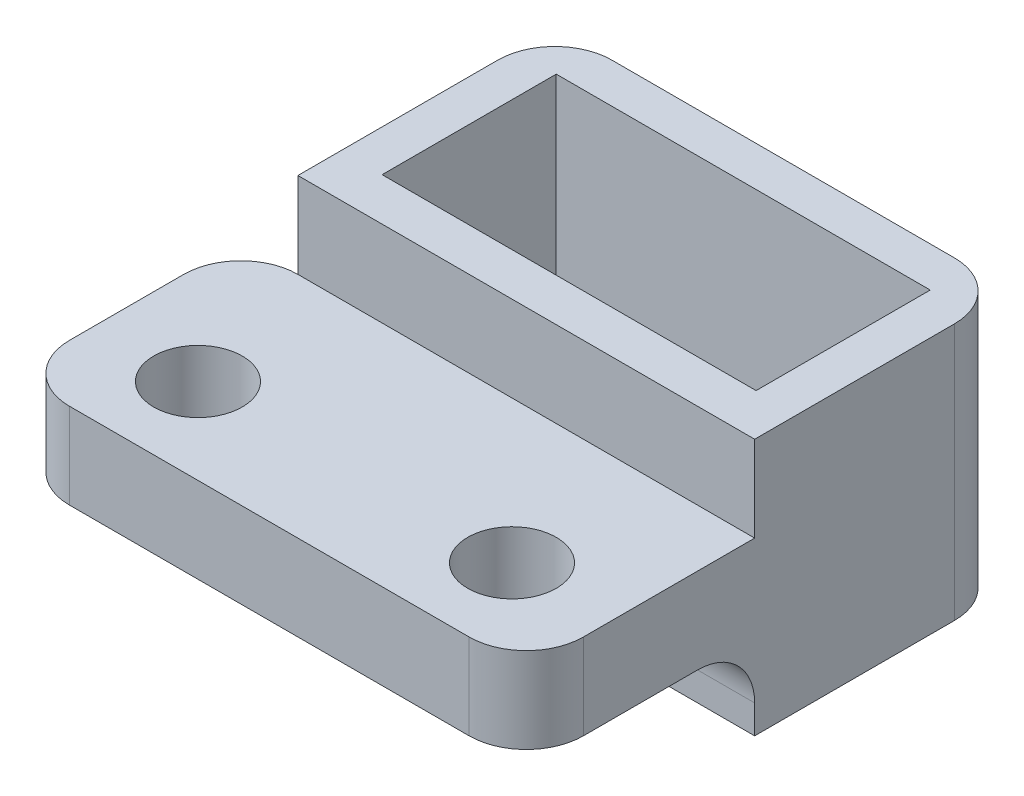
ISO-10303-21;
HEADER;
FILE_DESCRIPTION(('STEP AP214'),'2;1');
FILE_NAME('part.step','',(''),(''),'','','');
FILE_SCHEMA(('AUTOMOTIVE_DESIGN { 1 0 10303 214 1 1 1 1 }'));
ENDSEC;
DATA;
#1=APPLICATION_CONTEXT('core data for automotive mechanical design processes');
#2=APPLICATION_PROTOCOL_DEFINITION('international standard','automotive_design',2000,#1);
#3=PRODUCT_CONTEXT('',#1,'mechanical');
#4=PRODUCT('Part','Part','',(#3));
#5=PRODUCT_RELATED_PRODUCT_CATEGORY('part','',(#4));
#6=PRODUCT_DEFINITION_FORMATION('','',#4);
#7=PRODUCT_DEFINITION_CONTEXT('part definition',#1,'design');
#8=PRODUCT_DEFINITION('design','',#6,#7);
#9=PRODUCT_DEFINITION_SHAPE('','',#8);
#10=(LENGTH_UNIT() NAMED_UNIT(*) SI_UNIT(.MILLI.,.METRE.));
#11=(NAMED_UNIT(*) PLANE_ANGLE_UNIT() SI_UNIT($,.RADIAN.));
#12=(NAMED_UNIT(*) SI_UNIT($,.STERADIAN.) SOLID_ANGLE_UNIT());
#13=UNCERTAINTY_MEASURE_WITH_UNIT(LENGTH_MEASURE(1.E-05),#10,'distance_accuracy_value','');
#14=(GEOMETRIC_REPRESENTATION_CONTEXT(3) GLOBAL_UNCERTAINTY_ASSIGNED_CONTEXT((#13)) GLOBAL_UNIT_ASSIGNED_CONTEXT((#10,
#11,#12)) REPRESENTATION_CONTEXT('',''));
#15=CARTESIAN_POINT('',(0.,0.,0.));
#16=DIRECTION('',(0.,0.,1.));
#17=DIRECTION('',(1.,0.,0.));
#18=AXIS2_PLACEMENT_3D('',#15,#16,#17);
#19=CARTESIAN_POINT('',(3.45,-14.450605523645,-9.5));
#20=DIRECTION('',(0.,0.,1.));
#21=DIRECTION('',(1.,0.,0.));
#22=AXIS2_PLACEMENT_3D('',#19,#20,#21);
#23=PLANE('',#22);
#24=DIRECTION('',(-1.,0.,0.));
#25=VECTOR('',#24,1.);
#26=CARTESIAN_POINT('',(16.55,-0.5,-9.5));
#27=LINE('',#26,#25);
#28=CARTESIAN_POINT('',(16.55,-0.5,-9.5));
#29=VERTEX_POINT('',#28);
#30=CARTESIAN_POINT('',(3.45,-0.5,-9.5));
#31=VERTEX_POINT('',#30);
#32=EDGE_CURVE('E234',#29,#31,#27,.T.);
#33=ORIENTED_EDGE('',*,*,#32,.T.);
#34=DIRECTION('',(0.,1.,0.));
#35=VECTOR('',#34,1.);
#36=CARTESIAN_POINT('',(3.45,-14.450605523645,-9.5));
#37=LINE('',#36,#35);
#38=CARTESIAN_POINT('',(3.45,6.,-9.5));
#39=VERTEX_POINT('',#38);
#40=EDGE_CURVE('E267',#31,#39,#37,.T.);
#41=ORIENTED_EDGE('',*,*,#40,.T.);
#42=DIRECTION('',(1.,0.,0.));
#43=VECTOR('',#42,1.);
#44=CARTESIAN_POINT('',(3.45,6.,-9.5));
#45=LINE('',#44,#43);
#46=CARTESIAN_POINT('',(16.55,6.,-9.5));
#47=VERTEX_POINT('',#46);
#48=EDGE_CURVE('E260',#39,#47,#45,.T.);
#49=ORIENTED_EDGE('',*,*,#48,.T.);
#50=DIRECTION('',(0.,1.,0.));
#51=VECTOR('',#50,1.);
#52=CARTESIAN_POINT('',(16.55,-14.450605523645,-9.5));
#53=LINE('',#52,#51);
#54=EDGE_CURVE('E256',#29,#47,#53,.T.);
#55=ORIENTED_EDGE('',*,*,#54,.F.);
#56=EDGE_LOOP('',(#33,#41,#49,#55));
#57=FACE_BOUND('',#56,.T.);
#58=ADVANCED_FACE('F33',(#57),#23,.F.);
#59=CARTESIAN_POINT('',(16.55,-14.450605523645,-15.6));
#60=DIRECTION('',(1.,0.,0.));
#61=DIRECTION('',(0.,0.,-1.));
#62=AXIS2_PLACEMENT_3D('',#59,#60,#61);
#63=PLANE('',#62);
#64=DIRECTION('',(0.,0.,1.));
#65=VECTOR('',#64,1.);
#66=CARTESIAN_POINT('',(16.55,-0.5,-15.6));
#67=LINE('',#66,#65);
#68=CARTESIAN_POINT('',(16.55,-0.5,-15.6));
#69=VERTEX_POINT('',#68);
#70=EDGE_CURVE('E232',#69,#29,#67,.T.);
#71=ORIENTED_EDGE('',*,*,#70,.T.);
#72=ORIENTED_EDGE('',*,*,#54,.T.);
#73=DIRECTION('',(0.,0.,-1.));
#74=VECTOR('',#73,1.);
#75=CARTESIAN_POINT('',(16.55,6.,-15.6));
#76=LINE('',#75,#74);
#77=CARTESIAN_POINT('',(16.55,6.,-15.6));
#78=VERTEX_POINT('',#77);
#79=EDGE_CURVE('E257',#47,#78,#76,.T.);
#80=ORIENTED_EDGE('',*,*,#79,.T.);
#81=DIRECTION('',(0.,1.,0.));
#82=VECTOR('',#81,1.);
#83=CARTESIAN_POINT('',(16.55,-14.450605523645,-15.6));
#84=LINE('',#83,#82);
#85=EDGE_CURVE('E268',#69,#78,#84,.T.);
#86=ORIENTED_EDGE('',*,*,#85,.F.);
#87=EDGE_LOOP('',(#71,#72,#80,#86));
#88=FACE_BOUND('',#87,.T.);
#89=ADVANCED_FACE('F453',(#88),#63,.F.);
#90=CARTESIAN_POINT('',(3.45,-14.450605523645,-15.6));
#91=DIRECTION('',(0.,0.,-1.));
#92=DIRECTION('',(-1.,0.,0.));
#93=AXIS2_PLACEMENT_3D('',#90,#91,#92);
#94=PLANE('',#93);
#95=DIRECTION('',(1.,0.,0.));
#96=VECTOR('',#95,1.);
#97=CARTESIAN_POINT('',(3.45,-0.5,-15.6));
#98=LINE('',#97,#96);
#99=CARTESIAN_POINT('',(3.45,-0.5,-15.6));
#100=VERTEX_POINT('',#99);
#101=EDGE_CURVE('E227',#100,#69,#98,.T.);
#102=ORIENTED_EDGE('',*,*,#101,.T.);
#103=ORIENTED_EDGE('',*,*,#85,.T.);
#104=DIRECTION('',(-1.,0.,0.));
#105=VECTOR('',#104,1.);
#106=CARTESIAN_POINT('',(3.45,6.,-15.6));
#107=LINE('',#106,#105);
#108=CARTESIAN_POINT('',(3.45,6.,-15.6));
#109=VERTEX_POINT('',#108);
#110=EDGE_CURVE('E253',#78,#109,#107,.T.);
#111=ORIENTED_EDGE('',*,*,#110,.T.);
#112=DIRECTION('',(0.,1.,0.));
#113=VECTOR('',#112,1.);
#114=CARTESIAN_POINT('',(3.45,-14.450605523645,-15.6));
#115=LINE('',#114,#113);
#116=EDGE_CURVE('E265',#100,#109,#115,.T.);
#117=ORIENTED_EDGE('',*,*,#116,.F.);
#118=EDGE_LOOP('',(#102,#103,#111,#117));
#119=FACE_BOUND('',#118,.T.);
#120=ADVANCED_FACE('F446',(#119),#94,.F.);
#121=CARTESIAN_POINT('',(3.45,-14.450605523645,-15.6));
#122=DIRECTION('',(-1.,0.,0.));
#123=DIRECTION('',(0.,0.,1.));
#124=AXIS2_PLACEMENT_3D('',#121,#122,#123);
#125=PLANE('',#124);
#126=DIRECTION('',(0.,0.,-1.));
#127=VECTOR('',#126,1.);
#128=CARTESIAN_POINT('',(3.45,-0.5,-9.5));
#129=LINE('',#128,#127);
#130=EDGE_CURVE('E237',#31,#100,#129,.T.);
#131=ORIENTED_EDGE('',*,*,#130,.T.);
#132=ORIENTED_EDGE('',*,*,#116,.T.);
#133=DIRECTION('',(0.,0.,1.));
#134=VECTOR('',#133,1.);
#135=CARTESIAN_POINT('',(3.45,6.,-15.6));
#136=LINE('',#135,#134);
#137=EDGE_CURVE('E252',#109,#39,#136,.T.);
#138=ORIENTED_EDGE('',*,*,#137,.T.);
#139=ORIENTED_EDGE('',*,*,#40,.F.);
#140=EDGE_LOOP('',(#131,#132,#138,#139));
#141=FACE_BOUND('',#140,.T.);
#142=ADVANCED_FACE('F438',(#141),#125,.F.);
#143=CARTESIAN_POINT('',(0.,3.,0.));
#144=DIRECTION('',(0.,-1.,0.));
#145=DIRECTION('',(0.,0.,-1.));
#146=AXIS2_PLACEMENT_3D('',#143,#144,#145);
#147=PLANE('',#146);
#148=CARTESIAN_POINT('',(14.5,3.,-3.));
#149=DIRECTION('',(0.,1.,0.));
#150=DIRECTION('',(0.,0.,1.));
#151=AXIS2_PLACEMENT_3D('',#148,#149,#150);
#152=CIRCLE('',#151,1.55);
#153=CARTESIAN_POINT('',(14.5,3.,-1.45));
#154=VERTEX_POINT('',#153);
#155=EDGE_CURVE('E290',#154,#154,#152,.T.);
#156=ORIENTED_EDGE('',*,*,#155,.F.);
#157=EDGE_LOOP('',(#156));
#158=FACE_BOUND('',#157,.T.);
#159=CARTESIAN_POINT('',(3.5,3.,-3.));
#160=DIRECTION('',(0.,1.,0.));
#161=DIRECTION('',(0.,0.,1.));
#162=AXIS2_PLACEMENT_3D('',#159,#160,#161);
#163=CIRCLE('',#162,1.55);
#164=CARTESIAN_POINT('',(3.5,3.,-1.45));
#165=VERTEX_POINT('',#164);
#166=EDGE_CURVE('E296',#165,#165,#163,.T.);
#167=ORIENTED_EDGE('',*,*,#166,.F.);
#168=EDGE_LOOP('',(#167));
#169=FACE_BOUND('',#168,.T.);
#170=DIRECTION('',(1.,0.,0.));
#171=VECTOR('',#170,1.);
#172=CARTESIAN_POINT('',(0.,3.,0.));
#173=LINE('',#172,#171);
#174=CARTESIAN_POINT('',(2.,3.,0.));
#175=VERTEX_POINT('',#174);
#176=CARTESIAN_POINT('',(16.,3.,0.));
#177=VERTEX_POINT('',#176);
#178=EDGE_CURVE('E305',#175,#177,#173,.T.);
#179=ORIENTED_EDGE('',*,*,#178,.T.);
#180=CARTESIAN_POINT('',(16.,3.,-2.));
#181=DIRECTION('',(0.,-1.,0.));
#182=DIRECTION('',(0.,0.,-1.));
#183=AXIS2_PLACEMENT_3D('',#180,#181,#182);
#184=CIRCLE('',#183,2.);
#185=CARTESIAN_POINT('',(18.,3.,-2.));
#186=VERTEX_POINT('',#185);
#187=EDGE_CURVE('E342',#177,#186,#184,.F.);
#188=ORIENTED_EDGE('',*,*,#187,.T.);
#189=DIRECTION('',(0.,0.,-1.));
#190=VECTOR('',#189,1.);
#191=CARTESIAN_POINT('',(18.,3.,0.));
#192=LINE('',#191,#190);
#193=CARTESIAN_POINT('',(18.,3.,-8.));
#194=VERTEX_POINT('',#193);
#195=EDGE_CURVE('E309',#186,#194,#192,.T.);
#196=ORIENTED_EDGE('',*,*,#195,.T.);
#197=DIRECTION('',(1.,0.,0.));
#198=VECTOR('',#197,1.);
#199=CARTESIAN_POINT('',(0.,3.,-8.));
#200=LINE('',#199,#198);
#201=CARTESIAN_POINT('',(2.,3.,-8.));
#202=VERTEX_POINT('',#201);
#203=EDGE_CURVE('E278',#202,#194,#200,.T.);
#204=ORIENTED_EDGE('',*,*,#203,.F.);
#205=CARTESIAN_POINT('',(2.,3.,-6.));
#206=DIRECTION('',(0.,-1.,0.));
#207=DIRECTION('',(0.,0.,-1.));
#208=AXIS2_PLACEMENT_3D('',#205,#206,#207);
#209=CIRCLE('',#208,2.);
#210=CARTESIAN_POINT('',(0.,3.,-6.));
#211=VERTEX_POINT('',#210);
#212=EDGE_CURVE('E338',#202,#211,#209,.F.);
#213=ORIENTED_EDGE('',*,*,#212,.T.);
#214=DIRECTION('',(0.,0.,1.));
#215=VECTOR('',#214,1.);
#216=CARTESIAN_POINT('',(0.,3.,0.));
#217=LINE('',#216,#215);
#218=CARTESIAN_POINT('',(0.,3.,-2.));
#219=VERTEX_POINT('',#218);
#220=EDGE_CURVE('E302',#211,#219,#217,.T.);
#221=ORIENTED_EDGE('',*,*,#220,.T.);
#222=CARTESIAN_POINT('',(2.,3.,-2.));
#223=DIRECTION('',(0.,-1.,0.));
#224=DIRECTION('',(0.,0.,-1.));
#225=AXIS2_PLACEMENT_3D('',#222,#223,#224);
#226=CIRCLE('',#225,2.);
#227=EDGE_CURVE('E340',#219,#175,#226,.F.);
#228=ORIENTED_EDGE('',*,*,#227,.T.);
#229=EDGE_LOOP('',(#179,#188,#196,#204,#213,#221,#228));
#230=FACE_BOUND('',#229,.T.);
#231=ADVANCED_FACE('F436',(#158,#169,#230),#147,.F.);
#232=CARTESIAN_POINT('',(0.,0.,0.));
#233=DIRECTION('',(0.,-1.,0.));
#234=DIRECTION('',(0.,0.,-1.));
#235=AXIS2_PLACEMENT_3D('',#232,#233,#234);
#236=PLANE('',#235);
#237=DIRECTION('',(0.,0.,-1.));
#238=VECTOR('',#237,1.);
#239=CARTESIAN_POINT('',(18.,0.,0.));
#240=LINE('',#239,#238);
#241=CARTESIAN_POINT('',(18.,0.,-2.));
#242=VERTEX_POINT('',#241);
#243=CARTESIAN_POINT('',(18.,0.,-6.));
#244=VERTEX_POINT('',#243);
#245=EDGE_CURVE('E306',#242,#244,#240,.T.);
#246=ORIENTED_EDGE('',*,*,#245,.F.);
#247=CARTESIAN_POINT('',(16.,0.,-2.));
#248=DIRECTION('',(0.,-1.,0.));
#249=DIRECTION('',(0.,0.,-1.));
#250=AXIS2_PLACEMENT_3D('',#247,#248,#249);
#251=CIRCLE('',#250,2.);
#252=CARTESIAN_POINT('',(16.,0.,0.));
#253=VERTEX_POINT('',#252);
#254=EDGE_CURVE('E331',#242,#253,#251,.T.);
#255=ORIENTED_EDGE('',*,*,#254,.T.);
#256=DIRECTION('',(1.,0.,0.));
#257=VECTOR('',#256,1.);
#258=CARTESIAN_POINT('',(0.,0.,0.));
#259=LINE('',#258,#257);
#260=CARTESIAN_POINT('',(2.,0.,0.));
#261=VERTEX_POINT('',#260);
#262=EDGE_CURVE('E314',#261,#253,#259,.T.);
#263=ORIENTED_EDGE('',*,*,#262,.F.);
#264=CARTESIAN_POINT('',(2.,0.,-2.));
#265=DIRECTION('',(0.,-1.,0.));
#266=DIRECTION('',(0.,0.,-1.));
#267=AXIS2_PLACEMENT_3D('',#264,#265,#266);
#268=CIRCLE('',#267,2.);
#269=CARTESIAN_POINT('',(0.,0.,-2.));
#270=VERTEX_POINT('',#269);
#271=EDGE_CURVE('E329',#261,#270,#268,.T.);
#272=ORIENTED_EDGE('',*,*,#271,.T.);
#273=DIRECTION('',(0.,0.,1.));
#274=VECTOR('',#273,1.);
#275=CARTESIAN_POINT('',(0.,0.,0.));
#276=LINE('',#275,#274);
#277=CARTESIAN_POINT('',(0.,0.,-6.));
#278=VERTEX_POINT('',#277);
#279=EDGE_CURVE('E299',#278,#270,#276,.T.);
#280=ORIENTED_EDGE('',*,*,#279,.F.);
#281=CARTESIAN_POINT('',(2.,0.,-6.));
#282=DIRECTION('',(0.,-1.,0.));
#283=DIRECTION('',(0.,0.,-1.));
#284=AXIS2_PLACEMENT_3D('',#281,#282,#283);
#285=CIRCLE('',#284,2.);
#286=CARTESIAN_POINT('',(2.,0.,-8.));
#287=VERTEX_POINT('',#286);
#288=EDGE_CURVE('E327',#278,#287,#285,.T.);
#289=ORIENTED_EDGE('',*,*,#288,.T.);
#290=DIRECTION('',(0.,0.,1.));
#291=VECTOR('',#290,1.);
#292=CARTESIAN_POINT('',(2.,0.,0.));
#293=LINE('',#292,#291);
#294=CARTESIAN_POINT('',(2.,0.,-6.));
#295=VERTEX_POINT('',#294);
#296=EDGE_CURVE('E48',#287,#295,#293,.T.);
#297=ORIENTED_EDGE('',*,*,#296,.T.);
#298=DIRECTION('',(-1.,0.,0.));
#299=VECTOR('',#298,1.);
#300=CARTESIAN_POINT('',(0.,0.,-6.));
#301=LINE('',#300,#299);
#302=EDGE_CURVE('E324',#295,#244,#301,.F.);
#303=ORIENTED_EDGE('',*,*,#302,.T.);
#304=EDGE_LOOP('',(#246,#255,#263,#272,#280,#289,#297,#303));
#305=FACE_BOUND('',#304,.T.);
#306=CARTESIAN_POINT('',(3.5,0.,-3.));
#307=DIRECTION('',(0.,1.,0.));
#308=DIRECTION('',(0.,0.,1.));
#309=AXIS2_PLACEMENT_3D('',#306,#307,#308);
#310=CIRCLE('',#309,1.55);
#311=CARTESIAN_POINT('',(3.5,0.,-1.45));
#312=VERTEX_POINT('',#311);
#313=EDGE_CURVE('E293',#312,#312,#310,.T.);
#314=ORIENTED_EDGE('',*,*,#313,.T.);
#315=EDGE_LOOP('',(#314));
#316=FACE_BOUND('',#315,.T.);
#317=CARTESIAN_POINT('',(14.5,0.,-3.));
#318=DIRECTION('',(0.,1.,0.));
#319=DIRECTION('',(0.,0.,1.));
#320=AXIS2_PLACEMENT_3D('',#317,#318,#319);
#321=CIRCLE('',#320,1.55);
#322=CARTESIAN_POINT('',(14.5,0.,-1.45));
#323=VERTEX_POINT('',#322);
#324=EDGE_CURVE('E289',#323,#323,#321,.T.);
#325=ORIENTED_EDGE('',*,*,#324,.T.);
#326=EDGE_LOOP('',(#325));
#327=FACE_BOUND('',#326,.T.);
#328=ADVANCED_FACE('F371',(#305,#316,#327),#236,.T.);
#329=CARTESIAN_POINT('',(0.,3.,0.));
#330=DIRECTION('',(1.,0.,0.));
#331=DIRECTION('',(0.,0.,-1.));
#332=AXIS2_PLACEMENT_3D('',#329,#330,#331);
#333=PLANE('',#332);
#334=ORIENTED_EDGE('',*,*,#279,.T.);
#335=DIRECTION('',(0.,-1.,0.));
#336=VECTOR('',#335,1.);
#337=CARTESIAN_POINT('',(0.,3.,-2.));
#338=LINE('',#337,#336);
#339=EDGE_CURVE('E347',#270,#219,#338,.F.);
#340=ORIENTED_EDGE('',*,*,#339,.T.);
#341=ORIENTED_EDGE('',*,*,#220,.F.);
#342=DIRECTION('',(0.,-1.,0.));
#343=VECTOR('',#342,1.);
#344=CARTESIAN_POINT('',(0.,3.,-6.));
#345=LINE('',#344,#343);
#346=EDGE_CURVE('E344',#211,#278,#345,.T.);
#347=ORIENTED_EDGE('',*,*,#346,.T.);
#348=EDGE_LOOP('',(#334,#340,#341,#347));
#349=FACE_BOUND('',#348,.T.);
#350=ADVANCED_FACE('F430',(#349),#333,.F.);
#351=CARTESIAN_POINT('',(0.,3.,0.));
#352=DIRECTION('',(0.,0.,-1.));
#353=DIRECTION('',(-1.,0.,0.));
#354=AXIS2_PLACEMENT_3D('',#351,#352,#353);
#355=PLANE('',#354);
#356=ORIENTED_EDGE('',*,*,#262,.T.);
#357=DIRECTION('',(0.,-1.,0.));
#358=VECTOR('',#357,1.);
#359=CARTESIAN_POINT('',(16.,3.,0.));
#360=LINE('',#359,#358);
#361=EDGE_CURVE('E336',#253,#177,#360,.F.);
#362=ORIENTED_EDGE('',*,*,#361,.T.);
#363=ORIENTED_EDGE('',*,*,#178,.F.);
#364=DIRECTION('',(0.,-1.,0.));
#365=VECTOR('',#364,1.);
#366=CARTESIAN_POINT('',(2.,3.,0.));
#367=LINE('',#366,#365);
#368=EDGE_CURVE('E333',#175,#261,#367,.T.);
#369=ORIENTED_EDGE('',*,*,#368,.T.);
#370=EDGE_LOOP('',(#356,#362,#363,#369));
#371=FACE_BOUND('',#370,.T.);
#372=ADVANCED_FACE('F422',(#371),#355,.F.);
#373=CARTESIAN_POINT('',(18.,3.,0.));
#374=DIRECTION('',(-1.,0.,0.));
#375=DIRECTION('',(0.,0.,1.));
#376=AXIS2_PLACEMENT_3D('',#373,#374,#375);
#377=PLANE('',#376);
#378=ORIENTED_EDGE('',*,*,#195,.F.);
#379=DIRECTION('',(0.,-1.,0.));
#380=VECTOR('',#379,1.);
#381=CARTESIAN_POINT('',(18.,3.,-2.));
#382=LINE('',#381,#380);
#383=EDGE_CURVE('E321',#186,#242,#382,.T.);
#384=ORIENTED_EDGE('',*,*,#383,.T.);
#385=ORIENTED_EDGE('',*,*,#245,.T.);
#386=CARTESIAN_POINT('',(18.,-2.,-6.));
#387=DIRECTION('',(-1.,0.,0.));
#388=DIRECTION('',(0.,0.,1.));
#389=AXIS2_PLACEMENT_3D('',#386,#387,#388);
#390=CIRCLE('',#389,2.);
#391=CARTESIAN_POINT('',(18.,-2.,-8.));
#392=VERTEX_POINT('',#391);
#393=EDGE_CURVE('E11',#244,#392,#390,.T.);
#394=ORIENTED_EDGE('',*,*,#393,.T.);
#395=DIRECTION('',(0.,1.,0.));
#396=VECTOR('',#395,1.);
#397=CARTESIAN_POINT('',(18.,-3.,-8.));
#398=LINE('',#397,#396);
#399=CARTESIAN_POINT('',(18.,-3.,-8.));
#400=VERTEX_POINT('',#399);
#401=EDGE_CURVE('E249',#400,#392,#398,.T.);
#402=ORIENTED_EDGE('',*,*,#401,.F.);
#403=DIRECTION('',(0.,0.,1.));
#404=VECTOR('',#403,1.);
#405=CARTESIAN_POINT('',(18.,-3.,-18.));
#406=LINE('',#405,#404);
#407=CARTESIAN_POINT('',(18.,-3.,-15.));
#408=VERTEX_POINT('',#407);
#409=EDGE_CURVE('E239',#408,#400,#406,.T.);
#410=ORIENTED_EDGE('',*,*,#409,.F.);
#411=DIRECTION('',(0.,1.,0.));
#412=VECTOR('',#411,1.);
#413=CARTESIAN_POINT('',(18.,3.,-15.));
#414=LINE('',#413,#412);
#415=CARTESIAN_POINT('',(18.,6.,-15.));
#416=VERTEX_POINT('',#415);
#417=EDGE_CURVE('E311',#408,#416,#414,.T.);
#418=ORIENTED_EDGE('',*,*,#417,.T.);
#419=DIRECTION('',(0.,0.,-1.));
#420=VECTOR('',#419,1.);
#421=CARTESIAN_POINT('',(18.,6.,-18.));
#422=LINE('',#421,#420);
#423=CARTESIAN_POINT('',(18.,6.,-8.));
#424=VERTEX_POINT('',#423);
#425=EDGE_CURVE('E281',#424,#416,#422,.T.);
#426=ORIENTED_EDGE('',*,*,#425,.F.);
#427=DIRECTION('',(0.,-1.,0.));
#428=VECTOR('',#427,1.);
#429=CARTESIAN_POINT('',(18.,6.,-8.));
#430=LINE('',#429,#428);
#431=EDGE_CURVE('E284',#424,#194,#430,.T.);
#432=ORIENTED_EDGE('',*,*,#431,.T.);
#433=EDGE_LOOP('',(#378,#384,#385,#394,#402,#410,#418,#426,#432));
#434=FACE_BOUND('',#433,.T.);
#435=ADVANCED_FACE('F379',(#434),#377,.F.);
#436=CARTESIAN_POINT('',(3.5,3.,-3.));
#437=DIRECTION('',(0.,-1.,0.));
#438=DIRECTION('',(0.,0.,-1.));
#439=AXIS2_PLACEMENT_3D('',#436,#437,#438);
#440=CYLINDRICAL_SURFACE('',#439,1.55);
#441=ORIENTED_EDGE('',*,*,#166,.T.);
#442=EDGE_LOOP('',(#441));
#443=FACE_BOUND('',#442,.T.);
#444=ORIENTED_EDGE('',*,*,#313,.F.);
#445=EDGE_LOOP('',(#444));
#446=FACE_BOUND('',#445,.T.);
#447=ADVANCED_FACE('F471',(#443,#446),#440,.F.);
#448=CARTESIAN_POINT('',(14.5,3.,-3.));
#449=DIRECTION('',(0.,-1.,0.));
#450=DIRECTION('',(0.,0.,-1.));
#451=AXIS2_PLACEMENT_3D('',#448,#449,#450);
#452=CYLINDRICAL_SURFACE('',#451,1.55);
#453=ORIENTED_EDGE('',*,*,#155,.T.);
#454=EDGE_LOOP('',(#453));
#455=FACE_BOUND('',#454,.T.);
#456=ORIENTED_EDGE('',*,*,#324,.F.);
#457=EDGE_LOOP('',(#456));
#458=FACE_BOUND('',#457,.T.);
#459=ADVANCED_FACE('F469',(#455,#458),#452,.F.);
#460=CARTESIAN_POINT('',(0.,6.,-8.));
#461=DIRECTION('',(0.,0.,-1.));
#462=DIRECTION('',(-1.,0.,0.));
#463=AXIS2_PLACEMENT_3D('',#460,#461,#462);
#464=PLANE('',#463);
#465=DIRECTION('',(1.,0.,0.));
#466=VECTOR('',#465,1.);
#467=CARTESIAN_POINT('',(0.,6.,-8.));
#468=LINE('',#467,#466);
#469=CARTESIAN_POINT('',(2.,6.,-8.));
#470=VERTEX_POINT('',#469);
#471=EDGE_CURVE('E279',#470,#424,#468,.T.);
#472=ORIENTED_EDGE('',*,*,#471,.F.);
#473=DIRECTION('',(0.,-1.,0.));
#474=VECTOR('',#473,1.);
#475=CARTESIAN_POINT('',(2.,16.1980390271856,-8.));
#476=LINE('',#475,#474);
#477=EDGE_CURVE('E275',#470,#202,#476,.T.);
#478=ORIENTED_EDGE('',*,*,#477,.T.);
#479=ORIENTED_EDGE('',*,*,#203,.T.);
#480=ORIENTED_EDGE('',*,*,#431,.F.);
#481=EDGE_LOOP('',(#472,#478,#479,#480));
#482=FACE_BOUND('',#481,.T.);
#483=ADVANCED_FACE('F413',(#482),#464,.F.);
#484=CARTESIAN_POINT('',(0.,6.,0.));
#485=DIRECTION('',(0.,1.,0.));
#486=DIRECTION('',(0.,0.,1.));
#487=AXIS2_PLACEMENT_3D('',#484,#485,#486);
#488=PLANE('',#487);
#489=ORIENTED_EDGE('',*,*,#425,.T.);
#490=CARTESIAN_POINT('',(16.,6.,-15.));
#491=DIRECTION('',(0.,1.,0.));
#492=DIRECTION('',(0.,0.,1.));
#493=AXIS2_PLACEMENT_3D('',#490,#491,#492);
#494=CIRCLE('',#493,2.);
#495=CARTESIAN_POINT('',(16.,6.,-17.));
#496=VERTEX_POINT('',#495);
#497=EDGE_CURVE('E351',#416,#496,#494,.T.);
#498=ORIENTED_EDGE('',*,*,#497,.T.);
#499=DIRECTION('',(1.,0.,0.));
#500=VECTOR('',#499,1.);
#501=CARTESIAN_POINT('',(2.,6.,-17.));
#502=LINE('',#501,#500);
#503=CARTESIAN_POINT('',(4.,6.,-17.));
#504=VERTEX_POINT('',#503);
#505=EDGE_CURVE('E400',#504,#496,#502,.T.);
#506=ORIENTED_EDGE('',*,*,#505,.F.);
#507=CARTESIAN_POINT('',(4.,6.,-15.));
#508=DIRECTION('',(0.,1.,0.));
#509=DIRECTION('',(0.,0.,1.));
#510=AXIS2_PLACEMENT_3D('',#507,#508,#509);
#511=CIRCLE('',#510,2.);
#512=CARTESIAN_POINT('',(2.,6.,-15.));
#513=VERTEX_POINT('',#512);
#514=EDGE_CURVE('E349',#504,#513,#511,.T.);
#515=ORIENTED_EDGE('',*,*,#514,.T.);
#516=DIRECTION('',(0.,0.,1.));
#517=VECTOR('',#516,1.);
#518=CARTESIAN_POINT('',(2.,6.,-18.));
#519=LINE('',#518,#517);
#520=EDGE_CURVE('E272',#513,#470,#519,.T.);
#521=ORIENTED_EDGE('',*,*,#520,.T.);
#522=ORIENTED_EDGE('',*,*,#471,.T.);
#523=EDGE_LOOP('',(#489,#498,#506,#515,#521,#522));
#524=FACE_BOUND('',#523,.T.);
#525=ORIENTED_EDGE('',*,*,#48,.F.);
#526=ORIENTED_EDGE('',*,*,#137,.F.);
#527=ORIENTED_EDGE('',*,*,#110,.F.);
#528=ORIENTED_EDGE('',*,*,#79,.F.);
#529=EDGE_LOOP('',(#525,#526,#527,#528));
#530=FACE_BOUND('',#529,.T.);
#531=ADVANCED_FACE('F398',(#524,#530),#488,.T.);
#532=CARTESIAN_POINT('',(2.,16.1980390271856,-18.));
#533=DIRECTION('',(1.,0.,0.));
#534=DIRECTION('',(0.,0.,-1.));
#535=AXIS2_PLACEMENT_3D('',#532,#533,#534);
#536=PLANE('',#535);
#537=ORIENTED_EDGE('',*,*,#520,.F.);
#538=DIRECTION('',(0.,1.,0.));
#539=VECTOR('',#538,1.);
#540=CARTESIAN_POINT('',(2.,16.1980390271856,-15.));
#541=LINE('',#540,#539);
#542=CARTESIAN_POINT('',(2.,-3.,-15.));
#543=VERTEX_POINT('',#542);
#544=EDGE_CURVE('E362',#513,#543,#541,.F.);
#545=ORIENTED_EDGE('',*,*,#544,.T.);
#546=DIRECTION('',(0.,0.,-1.));
#547=VECTOR('',#546,1.);
#548=CARTESIAN_POINT('',(2.,-3.,-18.));
#549=LINE('',#548,#547);
#550=CARTESIAN_POINT('',(2.,-3.,-8.));
#551=VERTEX_POINT('',#550);
#552=EDGE_CURVE('E243',#551,#543,#549,.T.);
#553=ORIENTED_EDGE('',*,*,#552,.F.);
#554=DIRECTION('',(0.,1.,0.));
#555=VECTOR('',#554,1.);
#556=CARTESIAN_POINT('',(2.,-3.,-8.));
#557=LINE('',#556,#555);
#558=CARTESIAN_POINT('',(2.,-2.,-8.));
#559=VERTEX_POINT('',#558);
#560=EDGE_CURVE('E246',#551,#559,#557,.T.);
#561=ORIENTED_EDGE('',*,*,#560,.T.);
#562=CARTESIAN_POINT('',(2.,-2.,-6.));
#563=DIRECTION('',(1.,0.,0.));
#564=DIRECTION('',(0.,0.,-1.));
#565=AXIS2_PLACEMENT_3D('',#562,#563,#564);
#566=CIRCLE('',#565,2.);
#567=EDGE_CURVE('E41',#559,#295,#566,.T.);
#568=ORIENTED_EDGE('',*,*,#567,.T.);
#569=ORIENTED_EDGE('',*,*,#296,.F.);
#570=EDGE_CURVE('E274',#202,#287,#476,.T.);
#571=ORIENTED_EDGE('',*,*,#570,.F.);
#572=ORIENTED_EDGE('',*,*,#477,.F.);
#573=EDGE_LOOP('',(#537,#545,#553,#561,#568,#569,#571,#572));
#574=FACE_BOUND('',#573,.T.);
#575=ADVANCED_FACE('F366',(#574),#536,.F.);
#576=CARTESIAN_POINT('',(0.,-3.,0.));
#577=DIRECTION('',(0.,-1.,0.));
#578=DIRECTION('',(0.,0.,-1.));
#579=AXIS2_PLACEMENT_3D('',#576,#577,#578);
#580=PLANE('',#579);
#581=DIRECTION('',(1.,0.,0.));
#582=VECTOR('',#581,1.);
#583=CARTESIAN_POINT('',(2.,-3.,-17.));
#584=LINE('',#583,#582);
#585=CARTESIAN_POINT('',(4.,-3.,-17.));
#586=VERTEX_POINT('',#585);
#587=CARTESIAN_POINT('',(16.,-3.,-17.));
#588=VERTEX_POINT('',#587);
#589=EDGE_CURVE('E215',#586,#588,#584,.T.);
#590=ORIENTED_EDGE('',*,*,#589,.T.);
#591=CARTESIAN_POINT('',(16.,-3.,-15.));
#592=DIRECTION('',(0.,-1.,0.));
#593=DIRECTION('',(0.,0.,-1.));
#594=AXIS2_PLACEMENT_3D('',#591,#592,#593);
#595=CIRCLE('',#594,2.);
#596=EDGE_CURVE('E360',#588,#408,#595,.T.);
#597=ORIENTED_EDGE('',*,*,#596,.T.);
#598=ORIENTED_EDGE('',*,*,#409,.T.);
#599=DIRECTION('',(-1.,0.,0.));
#600=VECTOR('',#599,1.);
#601=CARTESIAN_POINT('',(18.,-3.,-8.));
#602=LINE('',#601,#600);
#603=EDGE_CURVE('E241',#400,#551,#602,.T.);
#604=ORIENTED_EDGE('',*,*,#603,.T.);
#605=ORIENTED_EDGE('',*,*,#552,.T.);
#606=CARTESIAN_POINT('',(4.,-3.,-15.));
#607=DIRECTION('',(0.,-1.,0.));
#608=DIRECTION('',(0.,0.,-1.));
#609=AXIS2_PLACEMENT_3D('',#606,#607,#608);
#610=CIRCLE('',#609,2.);
#611=EDGE_CURVE('E358',#543,#586,#610,.T.);
#612=ORIENTED_EDGE('',*,*,#611,.T.);
#613=EDGE_LOOP('',(#590,#597,#598,#604,#605,#612));
#614=FACE_BOUND('',#613,.T.);
#615=DIRECTION('',(1.,0.,0.));
#616=VECTOR('',#615,1.);
#617=CARTESIAN_POINT('',(4.2,-3.,-14.85));
#618=LINE('',#617,#616);
#619=CARTESIAN_POINT('',(4.2,-3.,-14.85));
#620=VERTEX_POINT('',#619);
#621=CARTESIAN_POINT('',(15.8,-3.,-14.85));
#622=VERTEX_POINT('',#621);
#623=EDGE_CURVE('E191',#620,#622,#618,.T.);
#624=ORIENTED_EDGE('',*,*,#623,.F.);
#625=DIRECTION('',(0.,0.,-1.));
#626=VECTOR('',#625,1.);
#627=CARTESIAN_POINT('',(4.2,-3.,-10.25));
#628=LINE('',#627,#626);
#629=CARTESIAN_POINT('',(4.2,-3.,-10.25));
#630=VERTEX_POINT('',#629);
#631=EDGE_CURVE('E209',#630,#620,#628,.T.);
#632=ORIENTED_EDGE('',*,*,#631,.F.);
#633=DIRECTION('',(-1.,0.,0.));
#634=VECTOR('',#633,1.);
#635=CARTESIAN_POINT('',(15.8,-3.,-10.25));
#636=LINE('',#635,#634);
#637=CARTESIAN_POINT('',(15.8,-3.,-10.25));
#638=VERTEX_POINT('',#637);
#639=EDGE_CURVE('E212',#638,#630,#636,.T.);
#640=ORIENTED_EDGE('',*,*,#639,.F.);
#641=DIRECTION('',(0.,0.,1.));
#642=VECTOR('',#641,1.);
#643=CARTESIAN_POINT('',(15.8,-3.,-14.85));
#644=LINE('',#643,#642);
#645=EDGE_CURVE('E221',#622,#638,#644,.T.);
#646=ORIENTED_EDGE('',*,*,#645,.F.);
#647=EDGE_LOOP('',(#624,#632,#640,#646));
#648=FACE_BOUND('',#647,.T.);
#649=ADVANCED_FACE('F386',(#614,#648),#580,.T.);
#650=CARTESIAN_POINT('',(18.,-3.,-8.));
#651=DIRECTION('',(0.,0.,-1.));
#652=DIRECTION('',(-1.,0.,0.));
#653=AXIS2_PLACEMENT_3D('',#650,#651,#652);
#654=PLANE('',#653);
#655=ORIENTED_EDGE('',*,*,#401,.T.);
#656=DIRECTION('',(-1.,0.,0.));
#657=VECTOR('',#656,1.);
#658=CARTESIAN_POINT('',(18.,-2.,-8.));
#659=LINE('',#658,#657);
#660=EDGE_CURVE('E364',#392,#559,#659,.T.);
#661=ORIENTED_EDGE('',*,*,#660,.T.);
#662=ORIENTED_EDGE('',*,*,#560,.F.);
#663=ORIENTED_EDGE('',*,*,#603,.F.);
#664=EDGE_LOOP('',(#655,#661,#662,#663));
#665=FACE_BOUND('',#664,.T.);
#666=ADVANCED_FACE('F383',(#665),#654,.F.);
#667=CARTESIAN_POINT('',(0.,-0.5,0.));
#668=DIRECTION('',(0.,-1.,0.));
#669=DIRECTION('',(0.,0.,-1.));
#670=AXIS2_PLACEMENT_3D('',#667,#668,#669);
#671=PLANE('',#670);
#672=DIRECTION('',(0.,0.,-1.));
#673=VECTOR('',#672,1.);
#674=CARTESIAN_POINT('',(4.2,-0.5,-10.25));
#675=LINE('',#674,#673);
#676=CARTESIAN_POINT('',(4.2,-0.5,-10.25));
#677=VERTEX_POINT('',#676);
#678=CARTESIAN_POINT('',(4.2,-0.5,-14.85));
#679=VERTEX_POINT('',#678);
#680=EDGE_CURVE('E196',#677,#679,#675,.T.);
#681=ORIENTED_EDGE('',*,*,#680,.T.);
#682=DIRECTION('',(1.,0.,0.));
#683=VECTOR('',#682,1.);
#684=CARTESIAN_POINT('',(4.2,-0.5,-14.85));
#685=LINE('',#684,#683);
#686=CARTESIAN_POINT('',(15.8,-0.5,-14.85));
#687=VERTEX_POINT('',#686);
#688=EDGE_CURVE('E188',#679,#687,#685,.T.);
#689=ORIENTED_EDGE('',*,*,#688,.T.);
#690=DIRECTION('',(0.,0.,1.));
#691=VECTOR('',#690,1.);
#692=CARTESIAN_POINT('',(15.8,-0.5,-14.85));
#693=LINE('',#692,#691);
#694=CARTESIAN_POINT('',(15.8,-0.5,-10.25));
#695=VERTEX_POINT('',#694);
#696=EDGE_CURVE('E200',#687,#695,#693,.T.);
#697=ORIENTED_EDGE('',*,*,#696,.T.);
#698=DIRECTION('',(-1.,0.,0.));
#699=VECTOR('',#698,1.);
#700=CARTESIAN_POINT('',(15.8,-0.5,-10.25));
#701=LINE('',#700,#699);
#702=EDGE_CURVE('E204',#695,#677,#701,.T.);
#703=ORIENTED_EDGE('',*,*,#702,.T.);
#704=EDGE_LOOP('',(#681,#689,#697,#703));
#705=FACE_BOUND('',#704,.T.);
#706=ORIENTED_EDGE('',*,*,#101,.F.);
#707=ORIENTED_EDGE('',*,*,#130,.F.);
#708=ORIENTED_EDGE('',*,*,#32,.F.);
#709=ORIENTED_EDGE('',*,*,#70,.F.);
#710=EDGE_LOOP('',(#706,#707,#708,#709));
#711=FACE_BOUND('',#710,.T.);
#712=ADVANCED_FACE('F206',(#705,#711),#671,.F.);
#713=CARTESIAN_POINT('',(4.2,-0.5,-14.85));
#714=DIRECTION('',(0.,0.,-1.));
#715=DIRECTION('',(-1.,0.,0.));
#716=AXIS2_PLACEMENT_3D('',#713,#714,#715);
#717=PLANE('',#716);
#718=ORIENTED_EDGE('',*,*,#623,.T.);
#719=DIRECTION('',(0.,-1.,0.));
#720=VECTOR('',#719,1.);
#721=CARTESIAN_POINT('',(15.8,-0.5,-14.85));
#722=LINE('',#721,#720);
#723=EDGE_CURVE('E184',#687,#622,#722,.T.);
#724=ORIENTED_EDGE('',*,*,#723,.F.);
#725=ORIENTED_EDGE('',*,*,#688,.F.);
#726=DIRECTION('',(0.,-1.,0.));
#727=VECTOR('',#726,1.);
#728=CARTESIAN_POINT('',(4.2,-0.5,-14.85));
#729=LINE('',#728,#727);
#730=EDGE_CURVE('E225',#679,#620,#729,.T.);
#731=ORIENTED_EDGE('',*,*,#730,.T.);
#732=EDGE_LOOP('',(#718,#724,#725,#731));
#733=FACE_BOUND('',#732,.T.);
#734=ADVANCED_FACE('F186',(#733),#717,.F.);
#735=CARTESIAN_POINT('',(4.2,-0.5,-10.25));
#736=DIRECTION('',(-1.,0.,0.));
#737=DIRECTION('',(0.,0.,1.));
#738=AXIS2_PLACEMENT_3D('',#735,#736,#737);
#739=PLANE('',#738);
#740=ORIENTED_EDGE('',*,*,#631,.T.);
#741=ORIENTED_EDGE('',*,*,#730,.F.);
#742=ORIENTED_EDGE('',*,*,#680,.F.);
#743=DIRECTION('',(0.,-1.,0.));
#744=VECTOR('',#743,1.);
#745=CARTESIAN_POINT('',(4.2,-0.5,-10.25));
#746=LINE('',#745,#744);
#747=EDGE_CURVE('E228',#677,#630,#746,.T.);
#748=ORIENTED_EDGE('',*,*,#747,.T.);
#749=EDGE_LOOP('',(#740,#741,#742,#748));
#750=FACE_BOUND('',#749,.T.);
#751=ADVANCED_FACE('F629',(#750),#739,.F.);
#752=CARTESIAN_POINT('',(15.8,-0.5,-10.25));
#753=DIRECTION('',(0.,0.,1.));
#754=DIRECTION('',(1.,0.,0.));
#755=AXIS2_PLACEMENT_3D('',#752,#753,#754);
#756=PLANE('',#755);
#757=ORIENTED_EDGE('',*,*,#639,.T.);
#758=ORIENTED_EDGE('',*,*,#747,.F.);
#759=ORIENTED_EDGE('',*,*,#702,.F.);
#760=DIRECTION('',(0.,-1.,0.));
#761=VECTOR('',#760,1.);
#762=CARTESIAN_POINT('',(15.8,-0.5,-10.25));
#763=LINE('',#762,#761);
#764=EDGE_CURVE('E195',#695,#638,#763,.T.);
#765=ORIENTED_EDGE('',*,*,#764,.T.);
#766=EDGE_LOOP('',(#757,#758,#759,#765));
#767=FACE_BOUND('',#766,.T.);
#768=ADVANCED_FACE('F620',(#767),#756,.F.);
#769=CARTESIAN_POINT('',(15.8,-0.5,-14.85));
#770=DIRECTION('',(1.,0.,0.));
#771=DIRECTION('',(0.,0.,-1.));
#772=AXIS2_PLACEMENT_3D('',#769,#770,#771);
#773=PLANE('',#772);
#774=ORIENTED_EDGE('',*,*,#645,.T.);
#775=ORIENTED_EDGE('',*,*,#764,.F.);
#776=ORIENTED_EDGE('',*,*,#696,.F.);
#777=ORIENTED_EDGE('',*,*,#723,.T.);
#778=EDGE_LOOP('',(#774,#775,#776,#777));
#779=FACE_BOUND('',#778,.T.);
#780=ADVANCED_FACE('F201',(#779),#773,.F.);
#781=CARTESIAN_POINT('',(2.,-19.0312195418814,-17.));
#782=DIRECTION('',(0.,0.,1.));
#783=DIRECTION('',(1.,0.,0.));
#784=AXIS2_PLACEMENT_3D('',#781,#782,#783);
#785=PLANE('',#784);
#786=ORIENTED_EDGE('',*,*,#505,.T.);
#787=DIRECTION('',(0.,1.,0.));
#788=VECTOR('',#787,1.);
#789=CARTESIAN_POINT('',(16.,-19.0312195418814,-17.));
#790=LINE('',#789,#788);
#791=EDGE_CURVE('E356',#496,#588,#790,.F.);
#792=ORIENTED_EDGE('',*,*,#791,.T.);
#793=ORIENTED_EDGE('',*,*,#589,.F.);
#794=DIRECTION('',(0.,1.,0.));
#795=VECTOR('',#794,1.);
#796=CARTESIAN_POINT('',(4.,-19.0312195418814,-17.));
#797=LINE('',#796,#795);
#798=EDGE_CURVE('E353',#586,#504,#797,.T.);
#799=ORIENTED_EDGE('',*,*,#798,.T.);
#800=EDGE_LOOP('',(#786,#792,#793,#799));
#801=FACE_BOUND('',#800,.T.);
#802=ADVANCED_FACE('F402',(#801),#785,.F.);
#803=CARTESIAN_POINT('',(16.,3.,-2.));
#804=DIRECTION('',(0.,-1.,0.));
#805=DIRECTION('',(0.,0.,-1.));
#806=AXIS2_PLACEMENT_3D('',#803,#804,#805);
#807=CYLINDRICAL_SURFACE('',#806,2.);
#808=ORIENTED_EDGE('',*,*,#187,.F.);
#809=ORIENTED_EDGE('',*,*,#361,.F.);
#810=ORIENTED_EDGE('',*,*,#254,.F.);
#811=ORIENTED_EDGE('',*,*,#383,.F.);
#812=EDGE_LOOP('',(#808,#809,#810,#811));
#813=FACE_BOUND('',#812,.T.);
#814=ADVANCED_FACE('F418',(#813),#807,.T.);
#815=CARTESIAN_POINT('',(2.,3.,-2.));
#816=DIRECTION('',(0.,-1.,0.));
#817=DIRECTION('',(0.,0.,-1.));
#818=AXIS2_PLACEMENT_3D('',#815,#816,#817);
#819=CYLINDRICAL_SURFACE('',#818,2.);
#820=ORIENTED_EDGE('',*,*,#227,.F.);
#821=ORIENTED_EDGE('',*,*,#339,.F.);
#822=ORIENTED_EDGE('',*,*,#271,.F.);
#823=ORIENTED_EDGE('',*,*,#368,.F.);
#824=EDGE_LOOP('',(#820,#821,#822,#823));
#825=FACE_BOUND('',#824,.T.);
#826=ADVANCED_FACE('F427',(#825),#819,.T.);
#827=CARTESIAN_POINT('',(16.,3.,-15.));
#828=DIRECTION('',(0.,1.,0.));
#829=DIRECTION('',(0.,0.,1.));
#830=AXIS2_PLACEMENT_3D('',#827,#828,#829);
#831=CYLINDRICAL_SURFACE('',#830,2.);
#832=ORIENTED_EDGE('',*,*,#596,.F.);
#833=ORIENTED_EDGE('',*,*,#791,.F.);
#834=ORIENTED_EDGE('',*,*,#497,.F.);
#835=ORIENTED_EDGE('',*,*,#417,.F.);
#836=EDGE_LOOP('',(#832,#833,#834,#835));
#837=FACE_BOUND('',#836,.T.);
#838=ADVANCED_FACE('F393',(#837),#831,.T.);
#839=CARTESIAN_POINT('',(4.,-19.0312195418814,-15.));
#840=DIRECTION('',(0.,1.,0.));
#841=DIRECTION('',(0.,0.,1.));
#842=AXIS2_PLACEMENT_3D('',#839,#840,#841);
#843=CYLINDRICAL_SURFACE('',#842,2.);
#844=ORIENTED_EDGE('',*,*,#611,.F.);
#845=ORIENTED_EDGE('',*,*,#544,.F.);
#846=ORIENTED_EDGE('',*,*,#514,.F.);
#847=ORIENTED_EDGE('',*,*,#798,.F.);
#848=EDGE_LOOP('',(#844,#845,#846,#847));
#849=FACE_BOUND('',#848,.T.);
#850=ADVANCED_FACE('F406',(#849),#843,.T.);
#851=CARTESIAN_POINT('',(2.,3.,-6.));
#852=DIRECTION('',(0.,-1.,0.));
#853=DIRECTION('',(0.,0.,-1.));
#854=AXIS2_PLACEMENT_3D('',#851,#852,#853);
#855=CYLINDRICAL_SURFACE('',#854,2.);
#856=ORIENTED_EDGE('',*,*,#212,.F.);
#857=ORIENTED_EDGE('',*,*,#570,.T.);
#858=ORIENTED_EDGE('',*,*,#288,.F.);
#859=ORIENTED_EDGE('',*,*,#346,.F.);
#860=EDGE_LOOP('',(#856,#857,#858,#859));
#861=FACE_BOUND('',#860,.T.);
#862=ADVANCED_FACE('F435',(#861),#855,.T.);
#863=CARTESIAN_POINT('',(18.,-2.,-6.));
#864=DIRECTION('',(-1.,0.,0.));
#865=DIRECTION('',(0.,0.,1.));
#866=AXIS2_PLACEMENT_3D('',#863,#864,#865);
#867=CYLINDRICAL_SURFACE('',#866,2.);
#868=ORIENTED_EDGE('',*,*,#393,.F.);
#869=ORIENTED_EDGE('',*,*,#302,.F.);
#870=ORIENTED_EDGE('',*,*,#567,.F.);
#871=ORIENTED_EDGE('',*,*,#660,.F.);
#872=EDGE_LOOP('',(#868,#869,#870,#871));
#873=FACE_BOUND('',#872,.T.);
#874=ADVANCED_FACE('F35',(#873),#867,.F.);
#875=CLOSED_SHELL('',(#58,#89,#120,#142,#231,#328,#350,#372,#435,#447,#459,#483,#531,#575,#649,
#666,#712,#734,#751,#768,#780,#802,#814,#826,#838,#850,#862,#874));
#876=MANIFOLD_SOLID_BREP('B2',#875);
#877=ADVANCED_BREP_SHAPE_REPRESENTATION('',(#18,#876),#14);
#878=SHAPE_DEFINITION_REPRESENTATION(#9,#877);
ENDSEC;
END-ISO-10303-21;
